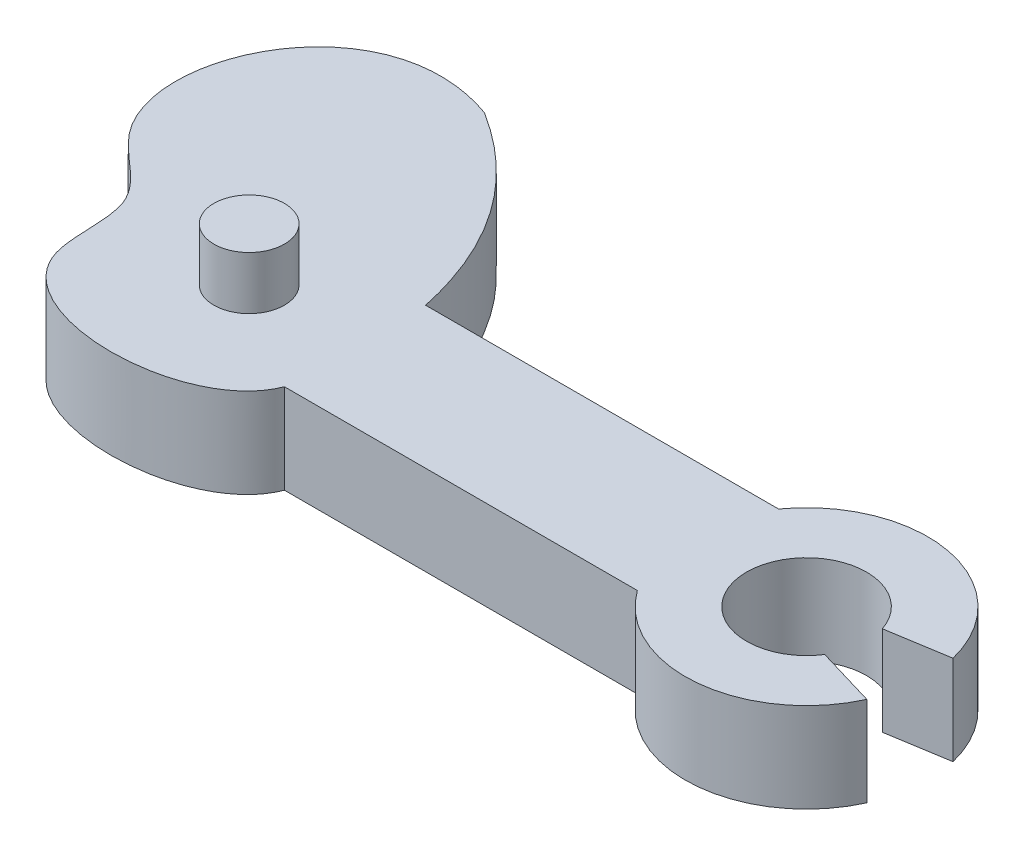
ISO-10303-21;
HEADER;
FILE_DESCRIPTION(('STEP AP214'),'2;1');
FILE_NAME('part.step','',(''),(''),'','','');
FILE_SCHEMA(('AUTOMOTIVE_DESIGN { 1 0 10303 214 1 1 1 1 }'));
ENDSEC;
DATA;
#1=APPLICATION_CONTEXT('core data for automotive mechanical design processes');
#2=APPLICATION_PROTOCOL_DEFINITION('international standard','automotive_design',2000,#1);
#3=PRODUCT_CONTEXT('',#1,'mechanical');
#4=PRODUCT('Part','Part','',(#3));
#5=PRODUCT_RELATED_PRODUCT_CATEGORY('part','',(#4));
#6=PRODUCT_DEFINITION_FORMATION('','',#4);
#7=PRODUCT_DEFINITION_CONTEXT('part definition',#1,'design');
#8=PRODUCT_DEFINITION('design','',#6,#7);
#9=PRODUCT_DEFINITION_SHAPE('','',#8);
#10=(LENGTH_UNIT() NAMED_UNIT(*) SI_UNIT(.MILLI.,.METRE.));
#11=(NAMED_UNIT(*) PLANE_ANGLE_UNIT() SI_UNIT($,.RADIAN.));
#12=(NAMED_UNIT(*) SI_UNIT($,.STERADIAN.) SOLID_ANGLE_UNIT());
#13=UNCERTAINTY_MEASURE_WITH_UNIT(LENGTH_MEASURE(1.E-05),#10,'distance_accuracy_value','');
#14=(GEOMETRIC_REPRESENTATION_CONTEXT(3) GLOBAL_UNCERTAINTY_ASSIGNED_CONTEXT((#13)) GLOBAL_UNIT_ASSIGNED_CONTEXT((#10,
#11,#12)) REPRESENTATION_CONTEXT('',''));
#15=CARTESIAN_POINT('',(0.,0.,0.));
#16=DIRECTION('',(0.,0.,1.));
#17=DIRECTION('',(1.,0.,0.));
#18=AXIS2_PLACEMENT_3D('',#15,#16,#17);
#19=CARTESIAN_POINT('',(12.794,2.54,0.));
#20=DIRECTION('',(0.,-1.,0.));
#21=DIRECTION('',(0.,0.,-1.));
#22=AXIS2_PLACEMENT_3D('',#19,#20,#21);
#23=CYLINDRICAL_SURFACE('',#22,1.7);
#24=CARTESIAN_POINT('',(12.794,0.,0.));
#25=DIRECTION('',(0.,1.,0.));
#26=DIRECTION('',(0.,0.,1.));
#27=AXIS2_PLACEMENT_3D('',#24,#25,#26);
#28=CIRCLE('',#27,1.7);
#29=CARTESIAN_POINT('',(14.2261023097936,0.,0.916014723835713));
#30=VERTEX_POINT('',#29);
#31=CARTESIAN_POINT('',(14.408639420947,0.,-0.531920614682185));
#32=VERTEX_POINT('',#31);
#33=EDGE_CURVE('E154',#30,#32,#28,.F.);
#34=ORIENTED_EDGE('',*,*,#33,.T.);
#35=DIRECTION('',(0.,-1.,0.));
#36=VECTOR('',#35,1.);
#37=CARTESIAN_POINT('',(14.408639420947,2.54,-0.531920614682185));
#38=LINE('',#37,#36);
#39=CARTESIAN_POINT('',(14.408639420947,2.54,-0.531920614682185));
#40=VERTEX_POINT('',#39);
#41=EDGE_CURVE('E50',#40,#32,#38,.T.);
#42=ORIENTED_EDGE('',*,*,#41,.F.);
#43=CARTESIAN_POINT('',(12.794,2.54,0.));
#44=DIRECTION('',(0.,1.,0.));
#45=DIRECTION('',(0.,0.,1.));
#46=AXIS2_PLACEMENT_3D('',#43,#44,#45);
#47=CIRCLE('',#46,1.7);
#48=CARTESIAN_POINT('',(14.2261023097936,2.54,0.916014723835713));
#49=VERTEX_POINT('',#48);
#50=EDGE_CURVE('E101',#49,#40,#47,.F.);
#51=ORIENTED_EDGE('',*,*,#50,.F.);
#52=DIRECTION('',(0.,-1.,0.));
#53=VECTOR('',#52,1.);
#54=CARTESIAN_POINT('',(14.2261023097936,2.54,0.916014723835713));
#55=LINE('',#54,#53);
#56=EDGE_CURVE('E153',#49,#30,#55,.T.);
#57=ORIENTED_EDGE('',*,*,#56,.T.);
#58=EDGE_LOOP('',(#34,#42,#51,#57));
#59=FACE_BOUND('',#58,.T.);
#60=ADVANCED_FACE('F41',(#59),#23,.F.);
#61=CARTESIAN_POINT('',(0.281759382160779,2.54,1.74677809510191));
#62=DIRECTION('',(0.159243995436628,0.,0.987239256673568));
#63=DIRECTION('',(0.987239256673568,0.,-0.159243995436628));
#64=AXIS2_PLACEMENT_3D('',#61,#62,#63);
#65=PLANE('',#64);
#66=DIRECTION('',(-0.987239256673568,0.,0.159243995436628));
#67=VECTOR('',#66,1.);
#68=CARTESIAN_POINT('',(0.281759382160779,0.,1.74677809510191));
#69=LINE('',#68,#67);
#70=CARTESIAN_POINT('',(16.1331889635571,0.,-0.810094479464426));
#71=VERTEX_POINT('',#70);
#72=EDGE_CURVE('E158',#71,#32,#69,.T.);
#73=ORIENTED_EDGE('',*,*,#72,.F.);
#74=DIRECTION('',(0.,-1.,0.));
#75=VECTOR('',#74,1.);
#76=CARTESIAN_POINT('',(16.1331889635571,2.54,-0.810094479464426));
#77=LINE('',#76,#75);
#78=CARTESIAN_POINT('',(16.1331889635571,2.54,-0.810094479464426));
#79=VERTEX_POINT('',#78);
#80=EDGE_CURVE('E210',#79,#71,#77,.T.);
#81=ORIENTED_EDGE('',*,*,#80,.F.);
#82=DIRECTION('',(-0.987239256673568,0.,0.159243995436628));
#83=VECTOR('',#82,1.);
#84=CARTESIAN_POINT('',(0.281759382160779,2.54,1.74677809510191));
#85=LINE('',#84,#83);
#86=EDGE_CURVE('E217',#79,#40,#85,.T.);
#87=ORIENTED_EDGE('',*,*,#86,.T.);
#88=ORIENTED_EDGE('',*,*,#41,.T.);
#89=EDGE_LOOP('',(#73,#81,#87,#88));
#90=FACE_BOUND('',#89,.T.);
#91=ADVANCED_FACE('F216',(#90),#65,.T.);
#92=CARTESIAN_POINT('',(12.794,2.54,0.));
#93=DIRECTION('',(0.,-1.,0.));
#94=DIRECTION('',(0.,0.,-1.));
#95=AXIS2_PLACEMENT_3D('',#92,#93,#94);
#96=CYLINDRICAL_SURFACE('',#95,3.43604947577883);
#97=CARTESIAN_POINT('',(12.794,0.,0.));
#98=DIRECTION('',(0.,1.,0.));
#99=DIRECTION('',(0.,0.,1.));
#100=AXIS2_PLACEMENT_3D('',#97,#98,#99);
#101=CIRCLE('',#100,3.43604947577883);
#102=CARTESIAN_POINT('',(10.,0.,-2.));
#103=VERTEX_POINT('',#102);
#104=EDGE_CURVE('E163',#103,#71,#101,.F.);
#105=ORIENTED_EDGE('',*,*,#104,.F.);
#106=DIRECTION('',(0.,-1.,0.));
#107=VECTOR('',#106,1.);
#108=CARTESIAN_POINT('',(10.,2.54,-2.));
#109=LINE('',#108,#107);
#110=CARTESIAN_POINT('',(10.,2.54,-2.));
#111=VERTEX_POINT('',#110);
#112=EDGE_CURVE('E207',#111,#103,#109,.T.);
#113=ORIENTED_EDGE('',*,*,#112,.F.);
#114=CARTESIAN_POINT('',(12.794,2.54,0.));
#115=DIRECTION('',(0.,1.,0.));
#116=DIRECTION('',(0.,0.,1.));
#117=AXIS2_PLACEMENT_3D('',#114,#115,#116);
#118=CIRCLE('',#117,3.43604947577883);
#119=EDGE_CURVE('E229',#111,#79,#118,.F.);
#120=ORIENTED_EDGE('',*,*,#119,.T.);
#121=ORIENTED_EDGE('',*,*,#80,.T.);
#122=EDGE_LOOP('',(#105,#113,#120,#121));
#123=FACE_BOUND('',#122,.T.);
#124=ADVANCED_FACE('F225',(#123),#96,.T.);
#125=CARTESIAN_POINT('',(0.,2.54,-2.));
#126=DIRECTION('',(0.,0.,1.));
#127=DIRECTION('',(1.,0.,0.));
#128=AXIS2_PLACEMENT_3D('',#125,#126,#127);
#129=PLANE('',#128);
#130=DIRECTION('',(-1.,0.,0.));
#131=VECTOR('',#130,1.);
#132=CARTESIAN_POINT('',(0.,0.,-2.));
#133=LINE('',#132,#131);
#134=CARTESIAN_POINT('',(0.,0.,-2.));
#135=VERTEX_POINT('',#134);
#136=EDGE_CURVE('E167',#103,#135,#133,.T.);
#137=ORIENTED_EDGE('',*,*,#136,.T.);
#138=DIRECTION('',(0.,-1.,0.));
#139=VECTOR('',#138,1.);
#140=CARTESIAN_POINT('',(0.,2.54,-2.));
#141=LINE('',#140,#139);
#142=CARTESIAN_POINT('',(0.,2.54,-2.));
#143=VERTEX_POINT('',#142);
#144=EDGE_CURVE('E204',#143,#135,#141,.T.);
#145=ORIENTED_EDGE('',*,*,#144,.F.);
#146=DIRECTION('',(-1.,0.,0.));
#147=VECTOR('',#146,1.);
#148=CARTESIAN_POINT('',(0.,2.54,-2.));
#149=LINE('',#148,#147);
#150=EDGE_CURVE('E234',#111,#143,#149,.T.);
#151=ORIENTED_EDGE('',*,*,#150,.F.);
#152=ORIENTED_EDGE('',*,*,#112,.T.);
#153=EDGE_LOOP('',(#137,#145,#151,#152));
#154=FACE_BOUND('',#153,.T.);
#155=ADVANCED_FACE('F254',(#154),#129,.F.);
#156=CARTESIAN_POINT('',(-3.89207128643076,2.54,-7.55845384981425));
#157=CARTESIAN_POINT('',(-0.771451313437752,2.54,-5.60167972688043));
#158=CARTESIAN_POINT('',(0.,2.54,-2.));
#159=B_SPLINE_CURVE_WITH_KNOTS('',2,(#156,#157,#158),.UNSPECIFIED.,.F.,.F.,(3,3),(0.,1.),.UNSPECIFIED.);
#160=DIRECTION('',(0.,-1.,0.));
#161=VECTOR('',#160,1.);
#162=SURFACE_OF_LINEAR_EXTRUSION('',#159,#161);
#163=CARTESIAN_POINT('',(-3.89207128643076,0.,-7.55845384981425));
#164=CARTESIAN_POINT('',(-0.771451313437752,0.,-5.60167972688043));
#165=CARTESIAN_POINT('',(0.,0.,-2.));
#166=B_SPLINE_CURVE_WITH_KNOTS('',2,(#163,#164,#165),.UNSPECIFIED.,.F.,.F.,(3,3),(0.,1.),.UNSPECIFIED.);
#167=CARTESIAN_POINT('',(-3.89207128643076,0.,-7.55845384981425));
#168=VERTEX_POINT('',#167);
#169=EDGE_CURVE('E171',#168,#135,#166,.T.);
#170=ORIENTED_EDGE('',*,*,#169,.F.);
#171=DIRECTION('',(0.,-1.,0.));
#172=VECTOR('',#171,1.);
#173=CARTESIAN_POINT('',(-3.89207128643076,2.54,-7.55845384981425));
#174=LINE('',#173,#172);
#175=CARTESIAN_POINT('',(-3.89207128643076,2.54,-7.55845384981425));
#176=VERTEX_POINT('',#175);
#177=EDGE_CURVE('E201',#176,#168,#174,.T.);
#178=ORIENTED_EDGE('',*,*,#177,.F.);
#179=EDGE_CURVE('E144',#176,#143,#159,.T.);
#180=ORIENTED_EDGE('',*,*,#179,.T.);
#181=ORIENTED_EDGE('',*,*,#144,.T.);
#182=EDGE_LOOP('',(#170,#178,#180,#181));
#183=FACE_BOUND('',#182,.T.);
#184=ADVANCED_FACE('F249',(#183),#162,.T.);
#185=CARTESIAN_POINT('',(0.,2.54,2.));
#186=CARTESIAN_POINT('',(-0.807019420727667,2.54,4.09860570024204));
#187=CARTESIAN_POINT('',(-7.36080053652823,2.54,4.19627669887293));
#188=CARTESIAN_POINT('',(-6.34345772525978,2.54,-0.548340216859602));
#189=CARTESIAN_POINT('',(-10.7782323983558,2.54,-2.92902577270383));
#190=CARTESIAN_POINT('',(-8.05166562519426,2.54,-9.04548340443192));
#191=CARTESIAN_POINT('',(-3.89207128643076,2.54,-7.55845384981425));
#192=B_SPLINE_CURVE_WITH_KNOTS('',3,(#185,#186,#187,#188,#189,#190,#191),.UNSPECIFIED.,.F.,.F.,
(4,1,1,1,4),(0.,0.355860312878933,0.470047608142096,0.583542680614252,1.),.UNSPECIFIED.);
#193=DIRECTION('',(0.,-1.,0.));
#194=VECTOR('',#193,1.);
#195=SURFACE_OF_LINEAR_EXTRUSION('',#192,#194);
#196=CARTESIAN_POINT('',(0.,0.,2.));
#197=CARTESIAN_POINT('',(-0.807019420727667,0.,4.09860570024204));
#198=CARTESIAN_POINT('',(-7.36080053652823,0.,4.19627669887293));
#199=CARTESIAN_POINT('',(-6.34345772525978,0.,-0.548340216859602));
#200=CARTESIAN_POINT('',(-10.7782323983558,0.,-2.92902577270383));
#201=CARTESIAN_POINT('',(-8.05166562519426,0.,-9.04548340443192));
#202=CARTESIAN_POINT('',(-3.89207128643076,0.,-7.55845384981425));
#203=B_SPLINE_CURVE_WITH_KNOTS('',3,(#196,#197,#198,#199,#200,#201,#202),.UNSPECIFIED.,.F.,.F.,
(4,1,1,1,4),(0.,0.355860312878933,0.470047608142096,0.583542680614252,1.),.UNSPECIFIED.);
#204=CARTESIAN_POINT('',(0.,0.,2.));
#205=VERTEX_POINT('',#204);
#206=EDGE_CURVE('E177',#205,#168,#203,.T.);
#207=ORIENTED_EDGE('',*,*,#206,.F.);
#208=DIRECTION('',(0.,-1.,0.));
#209=VECTOR('',#208,1.);
#210=CARTESIAN_POINT('',(0.,2.54,2.));
#211=LINE('',#210,#209);
#212=CARTESIAN_POINT('',(0.,2.54,2.));
#213=VERTEX_POINT('',#212);
#214=EDGE_CURVE('E129',#213,#205,#211,.T.);
#215=ORIENTED_EDGE('',*,*,#214,.F.);
#216=EDGE_CURVE('E140',#213,#176,#192,.T.);
#217=ORIENTED_EDGE('',*,*,#216,.T.);
#218=ORIENTED_EDGE('',*,*,#177,.T.);
#219=EDGE_LOOP('',(#207,#215,#217,#218));
#220=FACE_BOUND('',#219,.T.);
#221=ADVANCED_FACE('F253',(#220),#195,.T.);
#222=CARTESIAN_POINT('',(0.,2.54,2.));
#223=DIRECTION('',(0.,0.,1.));
#224=DIRECTION('',(1.,0.,0.));
#225=AXIS2_PLACEMENT_3D('',#222,#223,#224);
#226=PLANE('',#225);
#227=DIRECTION('',(-1.,0.,0.));
#228=VECTOR('',#227,1.);
#229=CARTESIAN_POINT('',(0.,0.,2.));
#230=LINE('',#229,#228);
#231=CARTESIAN_POINT('',(10.,0.,2.));
#232=VERTEX_POINT('',#231);
#233=EDGE_CURVE('E127',#232,#205,#230,.T.);
#234=ORIENTED_EDGE('',*,*,#233,.F.);
#235=DIRECTION('',(0.,-1.,0.));
#236=VECTOR('',#235,1.);
#237=CARTESIAN_POINT('',(10.,2.54,2.));
#238=LINE('',#237,#236);
#239=CARTESIAN_POINT('',(10.,2.54,2.));
#240=VERTEX_POINT('',#239);
#241=EDGE_CURVE('E121',#240,#232,#238,.T.);
#242=ORIENTED_EDGE('',*,*,#241,.F.);
#243=DIRECTION('',(-1.,0.,0.));
#244=VECTOR('',#243,1.);
#245=CARTESIAN_POINT('',(0.,2.54,2.));
#246=LINE('',#245,#244);
#247=EDGE_CURVE('E125',#240,#213,#246,.T.);
#248=ORIENTED_EDGE('',*,*,#247,.T.);
#249=ORIENTED_EDGE('',*,*,#214,.T.);
#250=EDGE_LOOP('',(#234,#242,#248,#249));
#251=FACE_BOUND('',#250,.T.);
#252=ADVANCED_FACE('F123',(#251),#226,.T.);
#253=CARTESIAN_POINT('',(12.794,2.54,0.));
#254=DIRECTION('',(0.,-1.,0.));
#255=DIRECTION('',(0.,0.,-1.));
#256=AXIS2_PLACEMENT_3D('',#253,#254,#255);
#257=CYLINDRICAL_SURFACE('',#256,3.43604947577883);
#258=CARTESIAN_POINT('',(12.794,0.,0.));
#259=DIRECTION('',(0.,1.,0.));
#260=DIRECTION('',(0.,0.,1.));
#261=AXIS2_PLACEMENT_3D('',#258,#259,#260);
#262=CIRCLE('',#261,3.43604947577883);
#263=CARTESIAN_POINT('',(15.9223503044234,0.,1.42121791883381));
#264=VERTEX_POINT('',#263);
#265=EDGE_CURVE('E89',#232,#264,#262,.T.);
#266=ORIENTED_EDGE('',*,*,#265,.T.);
#267=DIRECTION('',(0.,-1.,0.));
#268=VECTOR('',#267,1.);
#269=CARTESIAN_POINT('',(15.9223503044234,2.54,1.42121791883381));
#270=LINE('',#269,#268);
#271=CARTESIAN_POINT('',(15.9223503044234,2.54,1.42121791883381));
#272=VERTEX_POINT('',#271);
#273=EDGE_CURVE('E130',#272,#264,#270,.T.);
#274=ORIENTED_EDGE('',*,*,#273,.F.);
#275=CARTESIAN_POINT('',(12.794,2.54,0.));
#276=DIRECTION('',(0.,1.,0.));
#277=DIRECTION('',(0.,0.,1.));
#278=AXIS2_PLACEMENT_3D('',#275,#276,#277);
#279=CIRCLE('',#278,3.43604947577883);
#280=EDGE_CURVE('E132',#240,#272,#279,.T.);
#281=ORIENTED_EDGE('',*,*,#280,.F.);
#282=ORIENTED_EDGE('',*,*,#241,.T.);
#283=EDGE_LOOP('',(#266,#274,#281,#282));
#284=FACE_BOUND('',#283,.T.);
#285=ADVANCED_FACE('F133',(#284),#257,.T.);
#286=CARTESIAN_POINT('',(0.908528175015129,2.54,-3.05043418211133));
#287=DIRECTION('',(-0.285444325081709,0.,0.958395292809104));
#288=DIRECTION('',(0.958395292809104,0.,0.285444325081709));
#289=AXIS2_PLACEMENT_3D('',#286,#287,#288);
#290=PLANE('',#289);
#291=DIRECTION('',(-0.958395292809104,0.,-0.285444325081709));
#292=VECTOR('',#291,1.);
#293=CARTESIAN_POINT('',(0.908528175015129,0.,-3.05043418211133));
#294=LINE('',#293,#292);
#295=EDGE_CURVE('E95',#264,#30,#294,.T.);
#296=ORIENTED_EDGE('',*,*,#295,.T.);
#297=ORIENTED_EDGE('',*,*,#56,.F.);
#298=DIRECTION('',(-0.958395292809104,0.,-0.285444325081709));
#299=VECTOR('',#298,1.);
#300=CARTESIAN_POINT('',(0.908528175015129,2.54,-3.05043418211133));
#301=LINE('',#300,#299);
#302=EDGE_CURVE('E58',#272,#49,#301,.T.);
#303=ORIENTED_EDGE('',*,*,#302,.F.);
#304=ORIENTED_EDGE('',*,*,#273,.T.);
#305=EDGE_LOOP('',(#296,#297,#303,#304));
#306=FACE_BOUND('',#305,.T.);
#307=ADVANCED_FACE('F313',(#306),#290,.F.);
#308=CARTESIAN_POINT('',(0.,2.54,0.));
#309=DIRECTION('',(0.,1.,0.));
#310=DIRECTION('',(0.,0.,1.));
#311=AXIS2_PLACEMENT_3D('',#308,#309,#310);
#312=PLANE('',#311);
#313=CARTESIAN_POINT('',(-3.,2.54,0.));
#314=DIRECTION('',(0.,1.,0.));
#315=DIRECTION('',(0.,0.,1.));
#316=AXIS2_PLACEMENT_3D('',#313,#314,#315);
#317=CIRCLE('',#316,1.);
#318=CARTESIAN_POINT('',(-3.,2.54,1.));
#319=VERTEX_POINT('',#318);
#320=EDGE_CURVE('E391',#319,#319,#317,.T.);
#321=ORIENTED_EDGE('',*,*,#320,.F.);
#322=EDGE_LOOP('',(#321));
#323=FACE_BOUND('',#322,.T.);
#324=ORIENTED_EDGE('',*,*,#50,.T.);
#325=ORIENTED_EDGE('',*,*,#86,.F.);
#326=ORIENTED_EDGE('',*,*,#119,.F.);
#327=ORIENTED_EDGE('',*,*,#150,.T.);
#328=ORIENTED_EDGE('',*,*,#179,.F.);
#329=ORIENTED_EDGE('',*,*,#216,.F.);
#330=ORIENTED_EDGE('',*,*,#247,.F.);
#331=ORIENTED_EDGE('',*,*,#280,.T.);
#332=ORIENTED_EDGE('',*,*,#302,.T.);
#333=EDGE_LOOP('',(#324,#325,#326,#327,#328,#329,#330,#331,#332));
#334=FACE_BOUND('',#333,.T.);
#335=ADVANCED_FACE('F137',(#323,#334),#312,.T.);
#336=CARTESIAN_POINT('',(0.,0.,0.));
#337=DIRECTION('',(0.,1.,0.));
#338=DIRECTION('',(0.,0.,1.));
#339=AXIS2_PLACEMENT_3D('',#336,#337,#338);
#340=PLANE('',#339);
#341=CARTESIAN_POINT('',(-4.87243724358624,0.,-3.50133621740525));
#342=DIRECTION('',(0.,1.,0.));
#343=DIRECTION('',(0.,0.,1.));
#344=AXIS2_PLACEMENT_3D('',#341,#342,#343);
#345=CIRCLE('',#344,1.);
#346=CARTESIAN_POINT('',(-4.87243724358624,0.,-2.50133621740525));
#347=VERTEX_POINT('',#346);
#348=EDGE_CURVE('E11',#347,#347,#345,.F.);
#349=ORIENTED_EDGE('',*,*,#348,.F.);
#350=EDGE_LOOP('',(#349));
#351=FACE_BOUND('',#350,.T.);
#352=ORIENTED_EDGE('',*,*,#33,.F.);
#353=ORIENTED_EDGE('',*,*,#295,.F.);
#354=ORIENTED_EDGE('',*,*,#265,.F.);
#355=ORIENTED_EDGE('',*,*,#233,.T.);
#356=ORIENTED_EDGE('',*,*,#206,.T.);
#357=ORIENTED_EDGE('',*,*,#169,.T.);
#358=ORIENTED_EDGE('',*,*,#136,.F.);
#359=ORIENTED_EDGE('',*,*,#104,.T.);
#360=ORIENTED_EDGE('',*,*,#72,.T.);
#361=EDGE_LOOP('',(#352,#353,#354,#355,#356,#357,#358,#359,#360));
#362=FACE_BOUND('',#361,.T.);
#363=ADVANCED_FACE('F221',(#351,#362),#340,.F.);
#364=CARTESIAN_POINT('',(-3.,4.04,0.));
#365=DIRECTION('',(0.,-1.,0.));
#366=DIRECTION('',(0.,0.,-1.));
#367=AXIS2_PLACEMENT_3D('',#364,#365,#366);
#368=CYLINDRICAL_SURFACE('',#367,1.);
#369=CARTESIAN_POINT('',(-3.,4.04,0.));
#370=DIRECTION('',(0.,1.,0.));
#371=DIRECTION('',(0.,0.,1.));
#372=AXIS2_PLACEMENT_3D('',#369,#370,#371);
#373=CIRCLE('',#372,1.);
#374=CARTESIAN_POINT('',(-3.,4.04,1.));
#375=VERTEX_POINT('',#374);
#376=EDGE_CURVE('E159',#375,#375,#373,.T.);
#377=ORIENTED_EDGE('',*,*,#376,.F.);
#378=EDGE_LOOP('',(#377));
#379=FACE_BOUND('',#378,.T.);
#380=ORIENTED_EDGE('',*,*,#320,.T.);
#381=EDGE_LOOP('',(#380));
#382=FACE_BOUND('',#381,.T.);
#383=ADVANCED_FACE('F339',(#379,#382),#368,.T.);
#384=CARTESIAN_POINT('',(0.,4.04,0.));
#385=DIRECTION('',(0.,1.,0.));
#386=DIRECTION('',(0.,0.,1.));
#387=AXIS2_PLACEMENT_3D('',#384,#385,#386);
#388=PLANE('',#387);
#389=ORIENTED_EDGE('',*,*,#376,.T.);
#390=EDGE_LOOP('',(#389));
#391=FACE_BOUND('',#390,.T.);
#392=ADVANCED_FACE('F344',(#391),#388,.T.);
#393=CARTESIAN_POINT('',(-4.87243724358624,-1.5,-3.50133621740525));
#394=DIRECTION('',(0.,1.,0.));
#395=DIRECTION('',(0.,0.,1.));
#396=AXIS2_PLACEMENT_3D('',#393,#394,#395);
#397=CYLINDRICAL_SURFACE('',#396,1.);
#398=CARTESIAN_POINT('',(-4.87243724358624,-1.5,-3.50133621740525));
#399=DIRECTION('',(0.,-1.,0.));
#400=DIRECTION('',(0.,0.,-1.));
#401=AXIS2_PLACEMENT_3D('',#398,#399,#400);
#402=CIRCLE('',#401,1.);
#403=CARTESIAN_POINT('',(-4.87243724358624,-1.5,-4.50133621740525));
#404=VERTEX_POINT('',#403);
#405=EDGE_CURVE('E389',#404,#404,#402,.T.);
#406=ORIENTED_EDGE('',*,*,#405,.F.);
#407=EDGE_LOOP('',(#406));
#408=FACE_BOUND('',#407,.T.);
#409=ORIENTED_EDGE('',*,*,#348,.T.);
#410=EDGE_LOOP('',(#409));
#411=FACE_BOUND('',#410,.T.);
#412=ADVANCED_FACE('F355',(#408,#411),#397,.T.);
#413=CARTESIAN_POINT('',(-4.87243724358624,-1.5,-3.50133621740525));
#414=DIRECTION('',(0.,-1.,0.));
#415=DIRECTION('',(0.,0.,-1.));
#416=AXIS2_PLACEMENT_3D('',#413,#414,#415);
#417=PLANE('',#416);
#418=ORIENTED_EDGE('',*,*,#405,.T.);
#419=EDGE_LOOP('',(#418));
#420=FACE_BOUND('',#419,.T.);
#421=ADVANCED_FACE('F373',(#420),#417,.T.);
#422=CLOSED_SHELL('',(#60,#91,#124,#155,#184,#221,#252,#285,#307,#335,#363,#383,#392,#412,#421));
#423=MANIFOLD_SOLID_BREP('B2',#422);
#424=ADVANCED_BREP_SHAPE_REPRESENTATION('',(#18,#423),#14);
#425=SHAPE_DEFINITION_REPRESENTATION(#9,#424);
ENDSEC;
END-ISO-10303-21;
